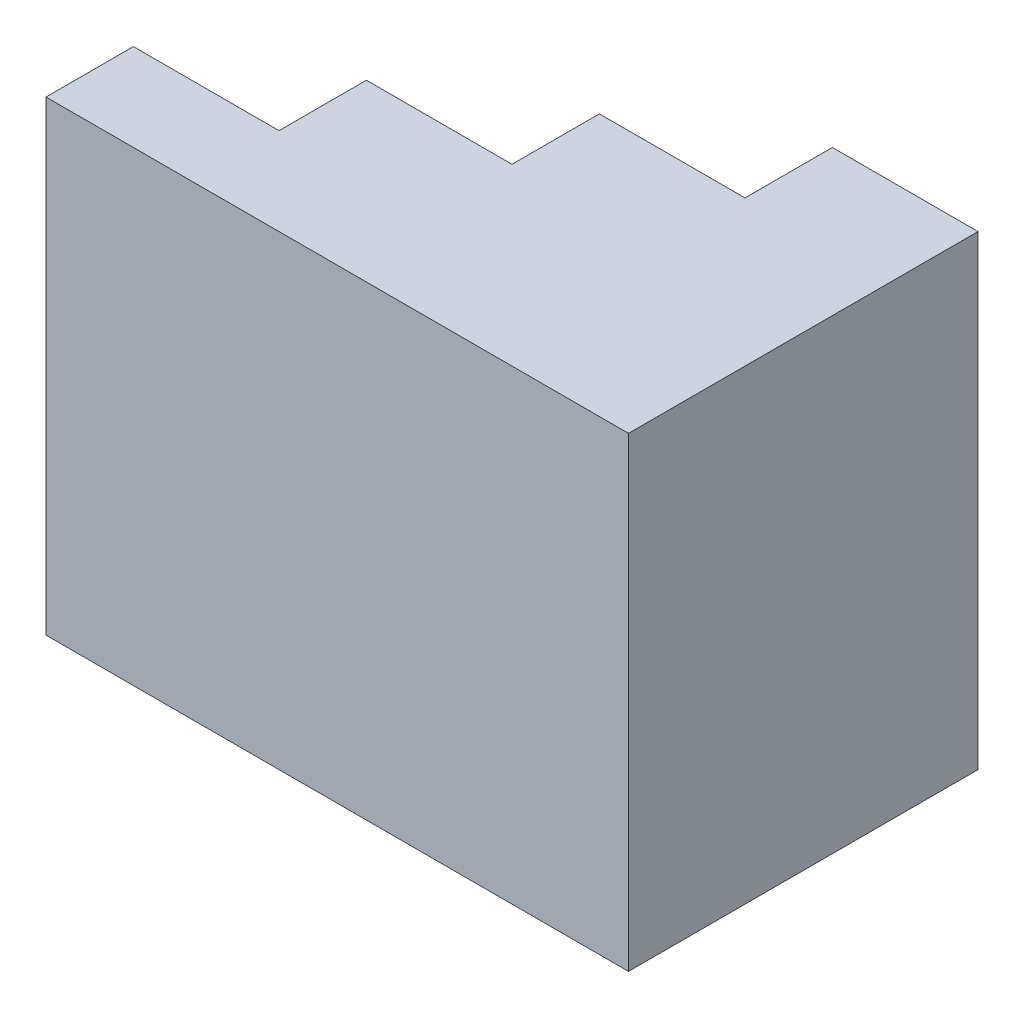
ISO-10303-21;
HEADER;
FILE_DESCRIPTION(('STEP AP214'),'2;1');
FILE_NAME('part.step','',(''),(''),'','','');
FILE_SCHEMA(('AUTOMOTIVE_DESIGN { 1 0 10303 214 1 1 1 1 }'));
ENDSEC;
DATA;
#1=APPLICATION_CONTEXT('core data for automotive mechanical design processes');
#2=APPLICATION_PROTOCOL_DEFINITION('international standard','automotive_design',2000,#1);
#3=PRODUCT_CONTEXT('',#1,'mechanical');
#4=PRODUCT('Part','Part','',(#3));
#5=PRODUCT_RELATED_PRODUCT_CATEGORY('part','',(#4));
#6=PRODUCT_DEFINITION_FORMATION('','',#4);
#7=PRODUCT_DEFINITION_CONTEXT('part definition',#1,'design');
#8=PRODUCT_DEFINITION('design','',#6,#7);
#9=PRODUCT_DEFINITION_SHAPE('','',#8);
#10=(LENGTH_UNIT() NAMED_UNIT(*) SI_UNIT(.MILLI.,.METRE.));
#11=(NAMED_UNIT(*) PLANE_ANGLE_UNIT() SI_UNIT($,.RADIAN.));
#12=(NAMED_UNIT(*) SI_UNIT($,.STERADIAN.) SOLID_ANGLE_UNIT());
#13=UNCERTAINTY_MEASURE_WITH_UNIT(LENGTH_MEASURE(1.E-05),#10,'distance_accuracy_value','');
#14=(GEOMETRIC_REPRESENTATION_CONTEXT(3) GLOBAL_UNCERTAINTY_ASSIGNED_CONTEXT((#13)) GLOBAL_UNIT_ASSIGNED_CONTEXT((#10,
#11,#12)) REPRESENTATION_CONTEXT('',''));
#15=CARTESIAN_POINT('',(0.,0.,0.));
#16=DIRECTION('',(0.,0.,1.));
#17=DIRECTION('',(1.,0.,0.));
#18=AXIS2_PLACEMENT_3D('',#15,#16,#17);
#19=CARTESIAN_POINT('',(25.,60.,0.));
#20=DIRECTION('',(-1.,0.,0.));
#21=DIRECTION('',(0.,0.,1.));
#22=AXIS2_PLACEMENT_3D('',#19,#20,#21);
#23=PLANE('',#22);
#24=DIRECTION('',(0.,0.,-1.));
#25=VECTOR('',#24,1.);
#26=CARTESIAN_POINT('',(25.,0.,0.));
#27=LINE('',#26,#25);
#28=CARTESIAN_POINT('',(25.,0.,-15.));
#29=VERTEX_POINT('',#28);
#30=CARTESIAN_POINT('',(25.,0.,-30.));
#31=VERTEX_POINT('',#30);
#32=EDGE_CURVE('E155',#29,#31,#27,.T.);
#33=ORIENTED_EDGE('',*,*,#32,.F.);
#34=DIRECTION('',(0.,-1.,0.));
#35=VECTOR('',#34,1.);
#36=CARTESIAN_POINT('',(25.,60.,-15.));
#37=LINE('',#36,#35);
#38=CARTESIAN_POINT('',(25.,60.,-15.));
#39=VERTEX_POINT('',#38);
#40=EDGE_CURVE('E11',#39,#29,#37,.T.);
#41=ORIENTED_EDGE('',*,*,#40,.F.);
#42=DIRECTION('',(0.,0.,-1.));
#43=VECTOR('',#42,1.);
#44=CARTESIAN_POINT('',(25.,60.,0.));
#45=LINE('',#44,#43);
#46=CARTESIAN_POINT('',(25.,60.,-30.));
#47=VERTEX_POINT('',#46);
#48=EDGE_CURVE('E179',#39,#47,#45,.T.);
#49=ORIENTED_EDGE('',*,*,#48,.T.);
#50=DIRECTION('',(0.,-1.,0.));
#51=VECTOR('',#50,1.);
#52=CARTESIAN_POINT('',(25.,60.,-30.));
#53=LINE('',#52,#51);
#54=EDGE_CURVE('E62',#47,#31,#53,.T.);
#55=ORIENTED_EDGE('',*,*,#54,.T.);
#56=EDGE_LOOP('',(#33,#41,#49,#55));
#57=FACE_BOUND('',#56,.T.);
#58=ADVANCED_FACE('F45',(#57),#23,.T.);
#59=CARTESIAN_POINT('',(0.,60.,-15.));
#60=DIRECTION('',(0.,0.,-1.));
#61=DIRECTION('',(-1.,0.,0.));
#62=AXIS2_PLACEMENT_3D('',#59,#60,#61);
#63=PLANE('',#62);
#64=DIRECTION('',(1.,0.,0.));
#65=VECTOR('',#64,1.);
#66=CARTESIAN_POINT('',(0.,0.,-15.));
#67=LINE('',#66,#65);
#68=CARTESIAN_POINT('',(0.,0.,-15.));
#69=VERTEX_POINT('',#68);
#70=EDGE_CURVE('E158',#69,#29,#67,.T.);
#71=ORIENTED_EDGE('',*,*,#70,.F.);
#72=DIRECTION('',(0.,-1.,0.));
#73=VECTOR('',#72,1.);
#74=CARTESIAN_POINT('',(0.,60.,-15.));
#75=LINE('',#74,#73);
#76=CARTESIAN_POINT('',(0.,60.,-15.));
#77=VERTEX_POINT('',#76);
#78=EDGE_CURVE('E54',#77,#69,#75,.T.);
#79=ORIENTED_EDGE('',*,*,#78,.F.);
#80=DIRECTION('',(1.,0.,0.));
#81=VECTOR('',#80,1.);
#82=CARTESIAN_POINT('',(0.,60.,-15.));
#83=LINE('',#82,#81);
#84=EDGE_CURVE('E219',#77,#39,#83,.T.);
#85=ORIENTED_EDGE('',*,*,#84,.T.);
#86=ORIENTED_EDGE('',*,*,#40,.T.);
#87=EDGE_LOOP('',(#71,#79,#85,#86));
#88=FACE_BOUND('',#87,.T.);
#89=ADVANCED_FACE('F207',(#88),#63,.T.);
#90=CARTESIAN_POINT('',(0.,60.,0.));
#91=DIRECTION('',(-1.,0.,0.));
#92=DIRECTION('',(0.,0.,1.));
#93=AXIS2_PLACEMENT_3D('',#90,#91,#92);
#94=PLANE('',#93);
#95=DIRECTION('',(0.,0.,-1.));
#96=VECTOR('',#95,1.);
#97=CARTESIAN_POINT('',(0.,0.,0.));
#98=LINE('',#97,#96);
#99=CARTESIAN_POINT('',(0.,0.,0.));
#100=VERTEX_POINT('',#99);
#101=EDGE_CURVE('E163',#100,#69,#98,.T.);
#102=ORIENTED_EDGE('',*,*,#101,.F.);
#103=DIRECTION('',(0.,-1.,0.));
#104=VECTOR('',#103,1.);
#105=CARTESIAN_POINT('',(0.,60.,0.));
#106=LINE('',#105,#104);
#107=CARTESIAN_POINT('',(0.,60.,0.));
#108=VERTEX_POINT('',#107);
#109=EDGE_CURVE('E194',#108,#100,#106,.T.);
#110=ORIENTED_EDGE('',*,*,#109,.F.);
#111=DIRECTION('',(0.,0.,-1.));
#112=VECTOR('',#111,1.);
#113=CARTESIAN_POINT('',(0.,60.,0.));
#114=LINE('',#113,#112);
#115=EDGE_CURVE('E203',#108,#77,#114,.T.);
#116=ORIENTED_EDGE('',*,*,#115,.T.);
#117=ORIENTED_EDGE('',*,*,#78,.T.);
#118=EDGE_LOOP('',(#102,#110,#116,#117));
#119=FACE_BOUND('',#118,.T.);
#120=ADVANCED_FACE('F201',(#119),#94,.T.);
#121=CARTESIAN_POINT('',(0.,60.,0.));
#122=DIRECTION('',(0.,0.,-1.));
#123=DIRECTION('',(-1.,0.,0.));
#124=AXIS2_PLACEMENT_3D('',#121,#122,#123);
#125=PLANE('',#124);
#126=DIRECTION('',(1.,0.,0.));
#127=VECTOR('',#126,1.);
#128=CARTESIAN_POINT('',(0.,0.,0.));
#129=LINE('',#128,#127);
#130=CARTESIAN_POINT('',(-25.,0.,0.));
#131=VERTEX_POINT('',#130);
#132=EDGE_CURVE('E167',#131,#100,#129,.T.);
#133=ORIENTED_EDGE('',*,*,#132,.F.);
#134=DIRECTION('',(0.,-1.,0.));
#135=VECTOR('',#134,1.);
#136=CARTESIAN_POINT('',(-25.,60.,0.));
#137=LINE('',#136,#135);
#138=CARTESIAN_POINT('',(-25.,60.,0.));
#139=VERTEX_POINT('',#138);
#140=EDGE_CURVE('E191',#139,#131,#137,.T.);
#141=ORIENTED_EDGE('',*,*,#140,.F.);
#142=DIRECTION('',(1.,0.,0.));
#143=VECTOR('',#142,1.);
#144=CARTESIAN_POINT('',(0.,60.,0.));
#145=LINE('',#144,#143);
#146=EDGE_CURVE('E216',#139,#108,#145,.T.);
#147=ORIENTED_EDGE('',*,*,#146,.T.);
#148=ORIENTED_EDGE('',*,*,#109,.T.);
#149=EDGE_LOOP('',(#133,#141,#147,#148));
#150=FACE_BOUND('',#149,.T.);
#151=ADVANCED_FACE('F213',(#150),#125,.T.);
#152=CARTESIAN_POINT('',(-25.,60.,0.));
#153=DIRECTION('',(-1.,0.,0.));
#154=DIRECTION('',(0.,0.,1.));
#155=AXIS2_PLACEMENT_3D('',#152,#153,#154);
#156=PLANE('',#155);
#157=DIRECTION('',(0.,0.,-1.));
#158=VECTOR('',#157,1.);
#159=CARTESIAN_POINT('',(-25.,0.,0.));
#160=LINE('',#159,#158);
#161=CARTESIAN_POINT('',(-25.,0.,15.));
#162=VERTEX_POINT('',#161);
#163=EDGE_CURVE('E171',#162,#131,#160,.T.);
#164=ORIENTED_EDGE('',*,*,#163,.F.);
#165=DIRECTION('',(0.,-1.,0.));
#166=VECTOR('',#165,1.);
#167=CARTESIAN_POINT('',(-25.,60.,15.));
#168=LINE('',#167,#166);
#169=CARTESIAN_POINT('',(-25.,60.,15.));
#170=VERTEX_POINT('',#169);
#171=EDGE_CURVE('E188',#170,#162,#168,.T.);
#172=ORIENTED_EDGE('',*,*,#171,.F.);
#173=DIRECTION('',(0.,0.,-1.));
#174=VECTOR('',#173,1.);
#175=CARTESIAN_POINT('',(-25.,60.,0.));
#176=LINE('',#175,#174);
#177=EDGE_CURVE('E224',#170,#139,#176,.T.);
#178=ORIENTED_EDGE('',*,*,#177,.T.);
#179=ORIENTED_EDGE('',*,*,#140,.T.);
#180=EDGE_LOOP('',(#164,#172,#178,#179));
#181=FACE_BOUND('',#180,.T.);
#182=ADVANCED_FACE('F285',(#181),#156,.T.);
#183=CARTESIAN_POINT('',(0.,60.,15.));
#184=DIRECTION('',(0.,0.,-1.));
#185=DIRECTION('',(-1.,0.,0.));
#186=AXIS2_PLACEMENT_3D('',#183,#184,#185);
#187=PLANE('',#186);
#188=DIRECTION('',(1.,0.,0.));
#189=VECTOR('',#188,1.);
#190=CARTESIAN_POINT('',(0.,0.,15.));
#191=LINE('',#190,#189);
#192=CARTESIAN_POINT('',(-50.,0.,15.));
#193=VERTEX_POINT('',#192);
#194=EDGE_CURVE('E175',#193,#162,#191,.T.);
#195=ORIENTED_EDGE('',*,*,#194,.F.);
#196=DIRECTION('',(0.,-1.,0.));
#197=VECTOR('',#196,1.);
#198=CARTESIAN_POINT('',(-50.,60.,15.));
#199=LINE('',#198,#197);
#200=CARTESIAN_POINT('',(-50.,60.,15.));
#201=VERTEX_POINT('',#200);
#202=EDGE_CURVE('E87',#201,#193,#199,.T.);
#203=ORIENTED_EDGE('',*,*,#202,.F.);
#204=DIRECTION('',(1.,0.,0.));
#205=VECTOR('',#204,1.);
#206=CARTESIAN_POINT('',(0.,60.,15.));
#207=LINE('',#206,#205);
#208=EDGE_CURVE('E231',#201,#170,#207,.T.);
#209=ORIENTED_EDGE('',*,*,#208,.T.);
#210=ORIENTED_EDGE('',*,*,#171,.T.);
#211=EDGE_LOOP('',(#195,#203,#209,#210));
#212=FACE_BOUND('',#211,.T.);
#213=ADVANCED_FACE('F288',(#212),#187,.T.);
#214=CARTESIAN_POINT('',(-50.,60.,0.));
#215=DIRECTION('',(-1.,0.,0.));
#216=DIRECTION('',(0.,0.,1.));
#217=AXIS2_PLACEMENT_3D('',#214,#215,#216);
#218=PLANE('',#217);
#219=ORIENTED_EDGE('',*,*,#202,.T.);
#220=DIRECTION('',(0.,0.,-1.));
#221=VECTOR('',#220,1.);
#222=CARTESIAN_POINT('',(-50.,0.,0.));
#223=LINE('',#222,#221);
#224=CARTESIAN_POINT('',(-50.,0.,-30.));
#225=VERTEX_POINT('',#224);
#226=EDGE_CURVE('E249',#193,#225,#223,.T.);
#227=ORIENTED_EDGE('',*,*,#226,.T.);
#228=DIRECTION('',(0.,1.,0.));
#229=VECTOR('',#228,1.);
#230=CARTESIAN_POINT('',(-50.,-20.,-30.));
#231=LINE('',#230,#229);
#232=CARTESIAN_POINT('',(-50.,-20.,-30.));
#233=VERTEX_POINT('',#232);
#234=EDGE_CURVE('E159',#233,#225,#231,.T.);
#235=ORIENTED_EDGE('',*,*,#234,.F.);
#236=DIRECTION('',(0.,0.,-1.));
#237=VECTOR('',#236,1.);
#238=CARTESIAN_POINT('',(-50.,-20.,0.));
#239=LINE('',#238,#237);
#240=CARTESIAN_POINT('',(-50.,-20.,30.));
#241=VERTEX_POINT('',#240);
#242=EDGE_CURVE('E240',#241,#233,#239,.T.);
#243=ORIENTED_EDGE('',*,*,#242,.F.);
#244=DIRECTION('',(0.,-1.,0.));
#245=VECTOR('',#244,1.);
#246=CARTESIAN_POINT('',(-50.,60.,30.));
#247=LINE('',#246,#245);
#248=CARTESIAN_POINT('',(-50.,60.,30.));
#249=VERTEX_POINT('',#248);
#250=EDGE_CURVE('E143',#249,#241,#247,.T.);
#251=ORIENTED_EDGE('',*,*,#250,.F.);
#252=DIRECTION('',(0.,0.,-1.));
#253=VECTOR('',#252,1.);
#254=CARTESIAN_POINT('',(-50.,60.,0.));
#255=LINE('',#254,#253);
#256=EDGE_CURVE('E127',#249,#201,#255,.T.);
#257=ORIENTED_EDGE('',*,*,#256,.T.);
#258=EDGE_LOOP('',(#219,#227,#235,#243,#251,#257));
#259=FACE_BOUND('',#258,.T.);
#260=ADVANCED_FACE('F235',(#259),#218,.T.);
#261=CARTESIAN_POINT('',(0.,60.,30.));
#262=DIRECTION('',(0.,0.,-1.));
#263=DIRECTION('',(-1.,0.,0.));
#264=AXIS2_PLACEMENT_3D('',#261,#262,#263);
#265=PLANE('',#264);
#266=ORIENTED_EDGE('',*,*,#250,.T.);
#267=DIRECTION('',(1.,0.,0.));
#268=VECTOR('',#267,1.);
#269=CARTESIAN_POINT('',(0.,-20.,30.));
#270=LINE('',#269,#268);
#271=CARTESIAN_POINT('',(50.,-20.,30.));
#272=VERTEX_POINT('',#271);
#273=EDGE_CURVE('E138',#241,#272,#270,.T.);
#274=ORIENTED_EDGE('',*,*,#273,.T.);
#275=DIRECTION('',(0.,-1.,0.));
#276=VECTOR('',#275,1.);
#277=CARTESIAN_POINT('',(50.,60.,30.));
#278=LINE('',#277,#276);
#279=CARTESIAN_POINT('',(50.,60.,30.));
#280=VERTEX_POINT('',#279);
#281=EDGE_CURVE('E134',#280,#272,#278,.T.);
#282=ORIENTED_EDGE('',*,*,#281,.F.);
#283=DIRECTION('',(1.,0.,0.));
#284=VECTOR('',#283,1.);
#285=CARTESIAN_POINT('',(0.,60.,30.));
#286=LINE('',#285,#284);
#287=EDGE_CURVE('E119',#249,#280,#286,.T.);
#288=ORIENTED_EDGE('',*,*,#287,.F.);
#289=EDGE_LOOP('',(#266,#274,#282,#288));
#290=FACE_BOUND('',#289,.T.);
#291=ADVANCED_FACE('F135',(#290),#265,.F.);
#292=CARTESIAN_POINT('',(50.,60.,0.));
#293=DIRECTION('',(-1.,0.,0.));
#294=DIRECTION('',(0.,0.,1.));
#295=AXIS2_PLACEMENT_3D('',#292,#293,#294);
#296=PLANE('',#295);
#297=ORIENTED_EDGE('',*,*,#281,.T.);
#298=DIRECTION('',(0.,0.,-1.));
#299=VECTOR('',#298,1.);
#300=CARTESIAN_POINT('',(50.,-20.,0.));
#301=LINE('',#300,#299);
#302=CARTESIAN_POINT('',(50.,-20.,-30.));
#303=VERTEX_POINT('',#302);
#304=EDGE_CURVE('E257',#272,#303,#301,.T.);
#305=ORIENTED_EDGE('',*,*,#304,.T.);
#306=DIRECTION('',(0.,-1.,0.));
#307=VECTOR('',#306,1.);
#308=CARTESIAN_POINT('',(50.,60.,-30.));
#309=LINE('',#308,#307);
#310=CARTESIAN_POINT('',(50.,60.,-30.));
#311=VERTEX_POINT('',#310);
#312=EDGE_CURVE('E144',#311,#303,#309,.T.);
#313=ORIENTED_EDGE('',*,*,#312,.F.);
#314=DIRECTION('',(0.,0.,-1.));
#315=VECTOR('',#314,1.);
#316=CARTESIAN_POINT('',(50.,60.,0.));
#317=LINE('',#316,#315);
#318=EDGE_CURVE('E124',#280,#311,#317,.T.);
#319=ORIENTED_EDGE('',*,*,#318,.F.);
#320=EDGE_LOOP('',(#297,#305,#313,#319));
#321=FACE_BOUND('',#320,.T.);
#322=ADVANCED_FACE('F146',(#321),#296,.F.);
#323=CARTESIAN_POINT('',(0.,60.,-30.));
#324=DIRECTION('',(0.,0.,-1.));
#325=DIRECTION('',(-1.,0.,0.));
#326=AXIS2_PLACEMENT_3D('',#323,#324,#325);
#327=PLANE('',#326);
#328=ORIENTED_EDGE('',*,*,#312,.T.);
#329=DIRECTION('',(1.,0.,0.));
#330=VECTOR('',#329,1.);
#331=CARTESIAN_POINT('',(0.,-20.,-30.));
#332=LINE('',#331,#330);
#333=EDGE_CURVE('E254',#233,#303,#332,.T.);
#334=ORIENTED_EDGE('',*,*,#333,.F.);
#335=ORIENTED_EDGE('',*,*,#234,.T.);
#336=DIRECTION('',(1.,0.,0.));
#337=VECTOR('',#336,1.);
#338=CARTESIAN_POINT('',(0.,0.,-30.));
#339=LINE('',#338,#337);
#340=EDGE_CURVE('E263',#225,#31,#339,.T.);
#341=ORIENTED_EDGE('',*,*,#340,.T.);
#342=ORIENTED_EDGE('',*,*,#54,.F.);
#343=DIRECTION('',(1.,0.,0.));
#344=VECTOR('',#343,1.);
#345=CARTESIAN_POINT('',(0.,60.,-30.));
#346=LINE('',#345,#344);
#347=EDGE_CURVE('E149',#47,#311,#346,.T.);
#348=ORIENTED_EDGE('',*,*,#347,.T.);
#349=EDGE_LOOP('',(#328,#334,#335,#341,#342,#348));
#350=FACE_BOUND('',#349,.T.);
#351=ADVANCED_FACE('F253',(#350),#327,.T.);
#352=CARTESIAN_POINT('',(0.,60.,0.));
#353=DIRECTION('',(0.,1.,0.));
#354=DIRECTION('',(0.,0.,1.));
#355=AXIS2_PLACEMENT_3D('',#352,#353,#354);
#356=PLANE('',#355);
#357=ORIENTED_EDGE('',*,*,#48,.F.);
#358=ORIENTED_EDGE('',*,*,#84,.F.);
#359=ORIENTED_EDGE('',*,*,#115,.F.);
#360=ORIENTED_EDGE('',*,*,#146,.F.);
#361=ORIENTED_EDGE('',*,*,#177,.F.);
#362=ORIENTED_EDGE('',*,*,#208,.F.);
#363=ORIENTED_EDGE('',*,*,#256,.F.);
#364=ORIENTED_EDGE('',*,*,#287,.T.);
#365=ORIENTED_EDGE('',*,*,#318,.T.);
#366=ORIENTED_EDGE('',*,*,#347,.F.);
#367=EDGE_LOOP('',(#357,#358,#359,#360,#361,#362,#363,#364,#365,#366));
#368=FACE_BOUND('',#367,.T.);
#369=ADVANCED_FACE('F121',(#368),#356,.T.);
#370=CARTESIAN_POINT('',(0.,-20.,0.));
#371=DIRECTION('',(0.,1.,0.));
#372=DIRECTION('',(0.,0.,1.));
#373=AXIS2_PLACEMENT_3D('',#370,#371,#372);
#374=PLANE('',#373);
#375=ORIENTED_EDGE('',*,*,#304,.F.);
#376=ORIENTED_EDGE('',*,*,#273,.F.);
#377=ORIENTED_EDGE('',*,*,#242,.T.);
#378=ORIENTED_EDGE('',*,*,#333,.T.);
#379=EDGE_LOOP('',(#375,#376,#377,#378));
#380=FACE_BOUND('',#379,.T.);
#381=ADVANCED_FACE('F256',(#380),#374,.F.);
#382=CARTESIAN_POINT('',(0.,0.,0.));
#383=DIRECTION('',(0.,1.,0.));
#384=DIRECTION('',(0.,0.,1.));
#385=AXIS2_PLACEMENT_3D('',#382,#383,#384);
#386=PLANE('',#385);
#387=ORIENTED_EDGE('',*,*,#70,.T.);
#388=ORIENTED_EDGE('',*,*,#32,.T.);
#389=ORIENTED_EDGE('',*,*,#340,.F.);
#390=ORIENTED_EDGE('',*,*,#226,.F.);
#391=ORIENTED_EDGE('',*,*,#194,.T.);
#392=ORIENTED_EDGE('',*,*,#163,.T.);
#393=ORIENTED_EDGE('',*,*,#132,.T.);
#394=ORIENTED_EDGE('',*,*,#101,.T.);
#395=EDGE_LOOP('',(#387,#388,#389,#390,#391,#392,#393,#394));
#396=FACE_BOUND('',#395,.T.);
#397=ADVANCED_FACE('F209',(#396),#386,.T.);
#398=CLOSED_SHELL('',(#58,#89,#120,#151,#182,#213,#260,#291,#322,#351,#369,#381,#397));
#399=MANIFOLD_SOLID_BREP('B2',#398);
#400=ADVANCED_BREP_SHAPE_REPRESENTATION('',(#18,#399),#14);
#401=SHAPE_DEFINITION_REPRESENTATION(#9,#400);
ENDSEC;
END-ISO-10303-21;
